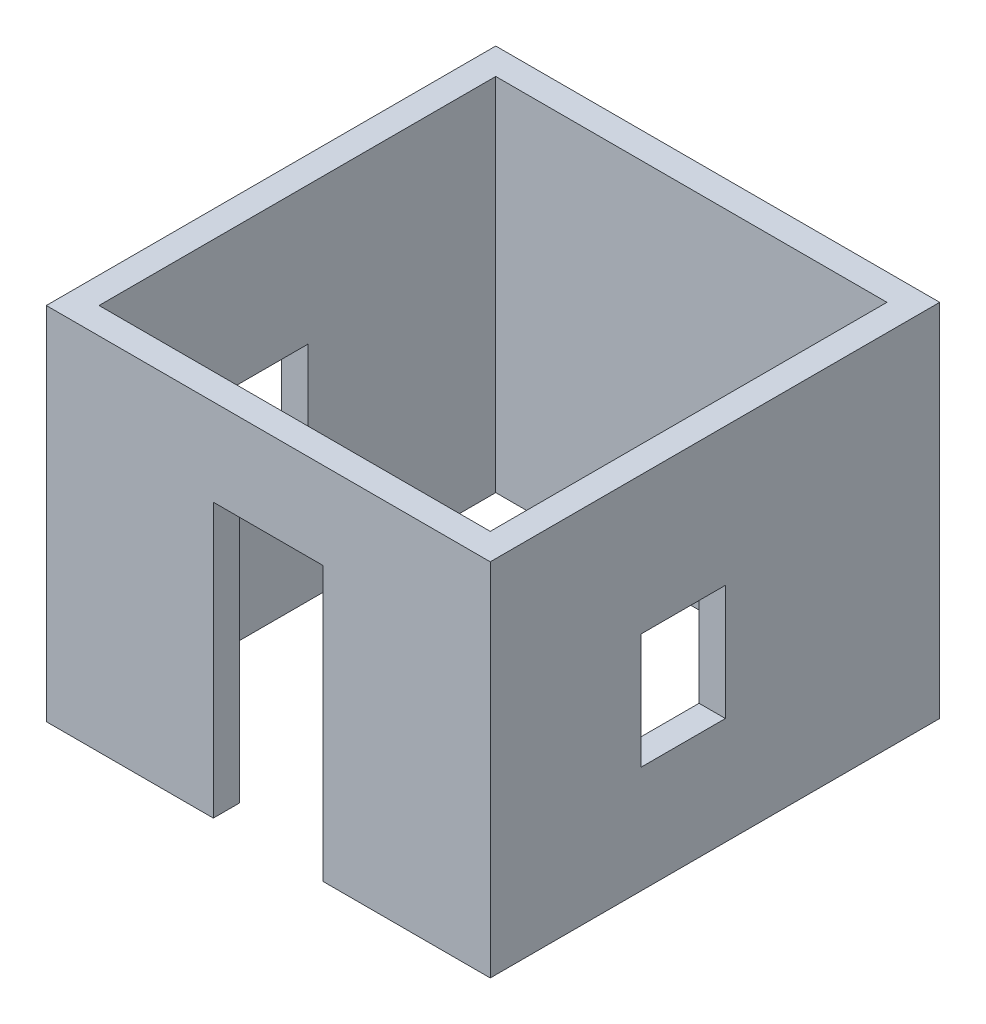
ISO-10303-21;
HEADER;
FILE_DESCRIPTION(('STEP AP214'),'2;1');
FILE_NAME('part.step','',(''),(''),'','','');
FILE_SCHEMA(('AUTOMOTIVE_DESIGN { 1 0 10303 214 1 1 1 1 }'));
ENDSEC;
DATA;
#1=APPLICATION_CONTEXT('core data for automotive mechanical design processes');
#2=APPLICATION_PROTOCOL_DEFINITION('international standard','automotive_design',2000,#1);
#3=PRODUCT_CONTEXT('',#1,'mechanical');
#4=PRODUCT('Part','Part','',(#3));
#5=PRODUCT_RELATED_PRODUCT_CATEGORY('part','',(#4));
#6=PRODUCT_DEFINITION_FORMATION('','',#4);
#7=PRODUCT_DEFINITION_CONTEXT('part definition',#1,'design');
#8=PRODUCT_DEFINITION('design','',#6,#7);
#9=PRODUCT_DEFINITION_SHAPE('','',#8);
#10=(LENGTH_UNIT() NAMED_UNIT(*) SI_UNIT(.MILLI.,.METRE.));
#11=(NAMED_UNIT(*) PLANE_ANGLE_UNIT() SI_UNIT($,.RADIAN.));
#12=(NAMED_UNIT(*) SI_UNIT($,.STERADIAN.) SOLID_ANGLE_UNIT());
#13=UNCERTAINTY_MEASURE_WITH_UNIT(LENGTH_MEASURE(1.E-05),#10,'distance_accuracy_value','');
#14=(GEOMETRIC_REPRESENTATION_CONTEXT(3) GLOBAL_UNCERTAINTY_ASSIGNED_CONTEXT((#13)) GLOBAL_UNIT_ASSIGNED_CONTEXT((#10,
#11,#12)) REPRESENTATION_CONTEXT('',''));
#15=CARTESIAN_POINT('',(0.,0.,0.));
#16=DIRECTION('',(0.,0.,1.));
#17=DIRECTION('',(1.,0.,0.));
#18=AXIS2_PLACEMENT_3D('',#15,#16,#17);
#19=CARTESIAN_POINT('',(0.,0.,0.));
#20=DIRECTION('',(0.,1.,0.));
#21=DIRECTION('',(0.,0.,1.));
#22=AXIS2_PLACEMENT_3D('',#19,#20,#21);
#23=PLANE('',#22);
#24=DIRECTION('',(1.,0.,0.));
#25=VECTOR('',#24,1.);
#26=CARTESIAN_POINT('',(0.,0.,2045.));
#27=LINE('',#26,#25);
#28=CARTESIAN_POINT('',(500.,4.44089209850063E-13,2045.));
#29=VERTEX_POINT('',#28);
#30=CARTESIAN_POINT('',(2020.,0.,2045.));
#31=VERTEX_POINT('',#30);
#32=EDGE_CURVE('E384',#29,#31,#27,.T.);
#33=ORIENTED_EDGE('',*,*,#32,.F.);
#34=DIRECTION('',(0.,0.,-1.));
#35=VECTOR('',#34,1.);
#36=CARTESIAN_POINT('',(500.,4.44089209850063E-13,2045.));
#37=LINE('',#36,#35);
#38=CARTESIAN_POINT('',(500.,4.44089209850063E-13,1805.));
#39=VERTEX_POINT('',#38);
#40=EDGE_CURVE('E289',#29,#39,#37,.T.);
#41=ORIENTED_EDGE('',*,*,#40,.T.);
#42=DIRECTION('',(1.,0.,0.));
#43=VECTOR('',#42,1.);
#44=CARTESIAN_POINT('',(-1780.,0.,1805.));
#45=LINE('',#44,#43);
#46=CARTESIAN_POINT('',(1780.,0.,1805.));
#47=VERTEX_POINT('',#46);
#48=EDGE_CURVE('E351',#39,#47,#45,.T.);
#49=ORIENTED_EDGE('',*,*,#48,.T.);
#50=DIRECTION('',(0.,0.,-1.));
#51=VECTOR('',#50,1.);
#52=CARTESIAN_POINT('',(1780.,0.,1805.));
#53=LINE('',#52,#51);
#54=CARTESIAN_POINT('',(1780.,0.,-1805.));
#55=VERTEX_POINT('',#54);
#56=EDGE_CURVE('E323',#47,#55,#53,.T.);
#57=ORIENTED_EDGE('',*,*,#56,.T.);
#58=DIRECTION('',(-1.,0.,0.));
#59=VECTOR('',#58,1.);
#60=CARTESIAN_POINT('',(-1780.,0.,-1805.));
#61=LINE('',#60,#59);
#62=CARTESIAN_POINT('',(1520.,0.,-1805.));
#63=VERTEX_POINT('',#62);
#64=EDGE_CURVE('E345',#55,#63,#61,.T.);
#65=ORIENTED_EDGE('',*,*,#64,.T.);
#66=DIRECTION('',(0.,0.,1.));
#67=VECTOR('',#66,1.);
#68=CARTESIAN_POINT('',(1520.,0.,-2045.));
#69=LINE('',#68,#67);
#70=CARTESIAN_POINT('',(1520.,0.,-2045.));
#71=VERTEX_POINT('',#70);
#72=EDGE_CURVE('E321',#71,#63,#69,.T.);
#73=ORIENTED_EDGE('',*,*,#72,.F.);
#74=DIRECTION('',(-1.,0.,0.));
#75=VECTOR('',#74,1.);
#76=CARTESIAN_POINT('',(0.,0.,-2045.));
#77=LINE('',#76,#75);
#78=CARTESIAN_POINT('',(2020.,0.,-2045.));
#79=VERTEX_POINT('',#78);
#80=EDGE_CURVE('E379',#79,#71,#77,.T.);
#81=ORIENTED_EDGE('',*,*,#80,.F.);
#82=DIRECTION('',(0.,0.,-1.));
#83=VECTOR('',#82,1.);
#84=CARTESIAN_POINT('',(2020.,0.,0.));
#85=LINE('',#84,#83);
#86=EDGE_CURVE('E364',#31,#79,#85,.T.);
#87=ORIENTED_EDGE('',*,*,#86,.F.);
#88=EDGE_LOOP('',(#33,#41,#49,#57,#65,#73,#81,#87));
#89=FACE_BOUND('',#88,.T.);
#90=ADVANCED_FACE('F62',(#89),#23,.F.);
#91=CARTESIAN_POINT('',(0.,3280.,0.));
#92=DIRECTION('',(0.,1.,0.));
#93=DIRECTION('',(0.,0.,1.));
#94=AXIS2_PLACEMENT_3D('',#91,#92,#93);
#95=PLANE('',#94);
#96=DIRECTION('',(0.,0.,-1.));
#97=VECTOR('',#96,1.);
#98=CARTESIAN_POINT('',(2020.,3280.,0.));
#99=LINE('',#98,#97);
#100=CARTESIAN_POINT('',(2020.,3280.,2045.));
#101=VERTEX_POINT('',#100);
#102=CARTESIAN_POINT('',(2020.,3280.,-2045.));
#103=VERTEX_POINT('',#102);
#104=EDGE_CURVE('E365',#101,#103,#99,.T.);
#105=ORIENTED_EDGE('',*,*,#104,.T.);
#106=DIRECTION('',(-1.,0.,0.));
#107=VECTOR('',#106,1.);
#108=CARTESIAN_POINT('',(0.,3280.,-2045.));
#109=LINE('',#108,#107);
#110=CARTESIAN_POINT('',(-2020.,3280.,-2045.));
#111=VERTEX_POINT('',#110);
#112=EDGE_CURVE('E368',#103,#111,#109,.T.);
#113=ORIENTED_EDGE('',*,*,#112,.T.);
#114=DIRECTION('',(0.,0.,1.));
#115=VECTOR('',#114,1.);
#116=CARTESIAN_POINT('',(-2020.,3280.,0.));
#117=LINE('',#116,#115);
#118=CARTESIAN_POINT('',(-2020.,3280.,2045.));
#119=VERTEX_POINT('',#118);
#120=EDGE_CURVE('E371',#111,#119,#117,.T.);
#121=ORIENTED_EDGE('',*,*,#120,.T.);
#122=DIRECTION('',(1.,0.,0.));
#123=VECTOR('',#122,1.);
#124=CARTESIAN_POINT('',(0.,3280.,2045.));
#125=LINE('',#124,#123);
#126=EDGE_CURVE('E373',#119,#101,#125,.T.);
#127=ORIENTED_EDGE('',*,*,#126,.T.);
#128=EDGE_LOOP('',(#105,#113,#121,#127));
#129=FACE_BOUND('',#128,.T.);
#130=DIRECTION('',(-1.,0.,0.));
#131=VECTOR('',#130,1.);
#132=CARTESIAN_POINT('',(-1780.,3280.,-1805.));
#133=LINE('',#132,#131);
#134=CARTESIAN_POINT('',(1780.,3280.,-1805.));
#135=VERTEX_POINT('',#134);
#136=CARTESIAN_POINT('',(-1780.,3280.,-1805.));
#137=VERTEX_POINT('',#136);
#138=EDGE_CURVE('E333',#135,#137,#133,.T.);
#139=ORIENTED_EDGE('',*,*,#138,.F.);
#140=DIRECTION('',(0.,0.,-1.));
#141=VECTOR('',#140,1.);
#142=CARTESIAN_POINT('',(1780.,3280.,1805.));
#143=LINE('',#142,#141);
#144=CARTESIAN_POINT('',(1780.,3280.,1805.));
#145=VERTEX_POINT('',#144);
#146=EDGE_CURVE('E331',#145,#135,#143,.T.);
#147=ORIENTED_EDGE('',*,*,#146,.F.);
#148=DIRECTION('',(1.,0.,0.));
#149=VECTOR('',#148,1.);
#150=CARTESIAN_POINT('',(-1780.,3280.,1805.));
#151=LINE('',#150,#149);
#152=CARTESIAN_POINT('',(-1780.,3280.,1805.));
#153=VERTEX_POINT('',#152);
#154=EDGE_CURVE('E339',#153,#145,#151,.T.);
#155=ORIENTED_EDGE('',*,*,#154,.F.);
#156=DIRECTION('',(0.,0.,1.));
#157=VECTOR('',#156,1.);
#158=CARTESIAN_POINT('',(-1780.,3280.,1805.));
#159=LINE('',#158,#157);
#160=EDGE_CURVE('E336',#137,#153,#159,.T.);
#161=ORIENTED_EDGE('',*,*,#160,.F.);
#162=EDGE_LOOP('',(#139,#147,#155,#161));
#163=FACE_BOUND('',#162,.T.);
#164=ADVANCED_FACE('F458',(#129,#163),#95,.T.);
#165=CARTESIAN_POINT('',(-1780.,0.,1805.));
#166=VERTEX_POINT('',#165);
#167=CARTESIAN_POINT('',(-500.,0.,1805.));
#168=VERTEX_POINT('',#167);
#169=EDGE_CURVE('E334',#166,#168,#45,.T.);
#170=ORIENTED_EDGE('',*,*,#169,.T.);
#171=DIRECTION('',(0.,0.,-1.));
#172=VECTOR('',#171,1.);
#173=CARTESIAN_POINT('',(-500.,5.66553889764798E-13,2045.));
#174=LINE('',#173,#172);
#175=CARTESIAN_POINT('',(-500.,5.66553889764798E-13,2045.));
#176=VERTEX_POINT('',#175);
#177=EDGE_CURVE('E301',#176,#168,#174,.T.);
#178=ORIENTED_EDGE('',*,*,#177,.F.);
#179=CARTESIAN_POINT('',(-2020.,0.,2045.));
#180=VERTEX_POINT('',#179);
#181=EDGE_CURVE('E369',#180,#176,#27,.T.);
#182=ORIENTED_EDGE('',*,*,#181,.F.);
#183=DIRECTION('',(0.,0.,1.));
#184=VECTOR('',#183,1.);
#185=CARTESIAN_POINT('',(-2020.,0.,0.));
#186=LINE('',#185,#184);
#187=CARTESIAN_POINT('',(-2020.,0.,-2045.));
#188=VERTEX_POINT('',#187);
#189=EDGE_CURVE('E382',#188,#180,#186,.T.);
#190=ORIENTED_EDGE('',*,*,#189,.F.);
#191=CARTESIAN_POINT('',(750.,0.,-2045.));
#192=VERTEX_POINT('',#191);
#193=EDGE_CURVE('E378',#192,#188,#77,.T.);
#194=ORIENTED_EDGE('',*,*,#193,.F.);
#195=DIRECTION('',(0.,0.,1.));
#196=VECTOR('',#195,1.);
#197=CARTESIAN_POINT('',(750.,0.,-2045.));
#198=LINE('',#197,#196);
#199=CARTESIAN_POINT('',(750.,0.,-1805.));
#200=VERTEX_POINT('',#199);
#201=EDGE_CURVE('E324',#192,#200,#198,.T.);
#202=ORIENTED_EDGE('',*,*,#201,.T.);
#203=CARTESIAN_POINT('',(-1780.,0.,-1805.));
#204=VERTEX_POINT('',#203);
#205=EDGE_CURVE('E344',#200,#204,#61,.T.);
#206=ORIENTED_EDGE('',*,*,#205,.T.);
#207=DIRECTION('',(0.,0.,1.));
#208=VECTOR('',#207,1.);
#209=CARTESIAN_POINT('',(-1780.,0.,1805.));
#210=LINE('',#209,#208);
#211=EDGE_CURVE('E348',#204,#166,#210,.T.);
#212=ORIENTED_EDGE('',*,*,#211,.T.);
#213=EDGE_LOOP('',(#170,#178,#182,#190,#194,#202,#206,#212));
#214=FACE_BOUND('',#213,.T.);
#215=ADVANCED_FACE('F436',(#214),#23,.F.);
#216=CARTESIAN_POINT('',(2020.,3280.,0.));
#217=DIRECTION('',(-1.,0.,0.));
#218=DIRECTION('',(0.,0.,1.));
#219=AXIS2_PLACEMENT_3D('',#216,#217,#218);
#220=PLANE('',#219);
#221=DIRECTION('',(0.,0.,1.));
#222=VECTOR('',#221,1.);
#223=CARTESIAN_POINT('',(2020.,2025.,675.));
#224=LINE('',#223,#222);
#225=CARTESIAN_POINT('',(2020.,2025.,-95.0000000000004));
#226=VERTEX_POINT('',#225);
#227=CARTESIAN_POINT('',(2020.,2025.,675.));
#228=VERTEX_POINT('',#227);
#229=EDGE_CURVE('E240',#226,#228,#224,.T.);
#230=ORIENTED_EDGE('',*,*,#229,.F.);
#231=DIRECTION('',(0.,1.,0.));
#232=VECTOR('',#231,1.);
#233=CARTESIAN_POINT('',(2020.,2025.,-95.0000000000004));
#234=LINE('',#233,#232);
#235=CARTESIAN_POINT('',(2020.,975.,-95.0000000000005));
#236=VERTEX_POINT('',#235);
#237=EDGE_CURVE('E77',#236,#226,#234,.T.);
#238=ORIENTED_EDGE('',*,*,#237,.F.);
#239=DIRECTION('',(0.,0.,-1.));
#240=VECTOR('',#239,1.);
#241=CARTESIAN_POINT('',(2020.,975.,675.));
#242=LINE('',#241,#240);
#243=CARTESIAN_POINT('',(2020.,975.,675.));
#244=VERTEX_POINT('',#243);
#245=EDGE_CURVE('E247',#244,#236,#242,.T.);
#246=ORIENTED_EDGE('',*,*,#245,.F.);
#247=DIRECTION('',(0.,-1.,0.));
#248=VECTOR('',#247,1.);
#249=CARTESIAN_POINT('',(2020.,2025.,675.));
#250=LINE('',#249,#248);
#251=EDGE_CURVE('E230',#228,#244,#250,.T.);
#252=ORIENTED_EDGE('',*,*,#251,.F.);
#253=EDGE_LOOP('',(#230,#238,#246,#252));
#254=FACE_BOUND('',#253,.T.);
#255=ORIENTED_EDGE('',*,*,#86,.T.);
#256=DIRECTION('',(0.,-1.,0.));
#257=VECTOR('',#256,1.);
#258=CARTESIAN_POINT('',(2020.,3280.,-2045.));
#259=LINE('',#258,#257);
#260=EDGE_CURVE('E395',#103,#79,#259,.T.);
#261=ORIENTED_EDGE('',*,*,#260,.F.);
#262=ORIENTED_EDGE('',*,*,#104,.F.);
#263=DIRECTION('',(0.,-1.,0.));
#264=VECTOR('',#263,1.);
#265=CARTESIAN_POINT('',(2020.,3280.,2045.));
#266=LINE('',#265,#264);
#267=EDGE_CURVE('E375',#101,#31,#266,.T.);
#268=ORIENTED_EDGE('',*,*,#267,.T.);
#269=EDGE_LOOP('',(#255,#261,#262,#268));
#270=FACE_BOUND('',#269,.T.);
#271=ADVANCED_FACE('F64',(#254,#270),#220,.F.);
#272=CARTESIAN_POINT('',(0.,3280.,-2045.));
#273=DIRECTION('',(0.,0.,1.));
#274=DIRECTION('',(1.,0.,0.));
#275=AXIS2_PLACEMENT_3D('',#272,#273,#274);
#276=PLANE('',#275);
#277=ORIENTED_EDGE('',*,*,#80,.T.);
#278=DIRECTION('',(0.,1.,0.));
#279=VECTOR('',#278,1.);
#280=CARTESIAN_POINT('',(1520.,0.,-2045.));
#281=LINE('',#280,#279);
#282=CARTESIAN_POINT('',(1520.,1960.,-2045.));
#283=VERTEX_POINT('',#282);
#284=EDGE_CURVE('E305',#71,#283,#281,.T.);
#285=ORIENTED_EDGE('',*,*,#284,.T.);
#286=DIRECTION('',(-1.,0.,0.));
#287=VECTOR('',#286,1.);
#288=CARTESIAN_POINT('',(1520.,1960.,-2045.));
#289=LINE('',#288,#287);
#290=CARTESIAN_POINT('',(750.,1960.,-2045.));
#291=VERTEX_POINT('',#290);
#292=EDGE_CURVE('E308',#283,#291,#289,.T.);
#293=ORIENTED_EDGE('',*,*,#292,.T.);
#294=DIRECTION('',(0.,-1.,0.));
#295=VECTOR('',#294,1.);
#296=CARTESIAN_POINT('',(750.,0.,-2045.));
#297=LINE('',#296,#295);
#298=EDGE_CURVE('E312',#291,#192,#297,.T.);
#299=ORIENTED_EDGE('',*,*,#298,.T.);
#300=ORIENTED_EDGE('',*,*,#193,.T.);
#301=DIRECTION('',(0.,-1.,0.));
#302=VECTOR('',#301,1.);
#303=CARTESIAN_POINT('',(-2020.,3280.,-2045.));
#304=LINE('',#303,#302);
#305=EDGE_CURVE('E392',#111,#188,#304,.T.);
#306=ORIENTED_EDGE('',*,*,#305,.F.);
#307=ORIENTED_EDGE('',*,*,#112,.F.);
#308=ORIENTED_EDGE('',*,*,#260,.T.);
#309=EDGE_LOOP('',(#277,#285,#293,#299,#300,#306,#307,#308));
#310=FACE_BOUND('',#309,.T.);
#311=ADVANCED_FACE('F423',(#310),#276,.F.);
#312=CARTESIAN_POINT('',(-2020.,3280.,0.));
#313=DIRECTION('',(1.,0.,0.));
#314=DIRECTION('',(0.,0.,-1.));
#315=AXIS2_PLACEMENT_3D('',#312,#313,#314);
#316=PLANE('',#315);
#317=DIRECTION('',(0.,0.,-1.));
#318=VECTOR('',#317,1.);
#319=CARTESIAN_POINT('',(-2020.,975.,675.));
#320=LINE('',#319,#318);
#321=CARTESIAN_POINT('',(-2020.,975.,675.));
#322=VERTEX_POINT('',#321);
#323=CARTESIAN_POINT('',(-2020.,975.,-95.0000000000005));
#324=VERTEX_POINT('',#323);
#325=EDGE_CURVE('E259',#322,#324,#320,.T.);
#326=ORIENTED_EDGE('',*,*,#325,.T.);
#327=DIRECTION('',(0.,1.,0.));
#328=VECTOR('',#327,1.);
#329=CARTESIAN_POINT('',(-2020.,2025.,-95.0000000000004));
#330=LINE('',#329,#328);
#331=CARTESIAN_POINT('',(-2020.,2025.,-95.0000000000004));
#332=VERTEX_POINT('',#331);
#333=EDGE_CURVE('E249',#324,#332,#330,.T.);
#334=ORIENTED_EDGE('',*,*,#333,.T.);
#335=DIRECTION('',(0.,0.,1.));
#336=VECTOR('',#335,1.);
#337=CARTESIAN_POINT('',(-2020.,2025.,675.));
#338=LINE('',#337,#336);
#339=CARTESIAN_POINT('',(-2020.,2025.,675.));
#340=VERTEX_POINT('',#339);
#341=EDGE_CURVE('E255',#332,#340,#338,.T.);
#342=ORIENTED_EDGE('',*,*,#341,.T.);
#343=DIRECTION('',(0.,-1.,0.));
#344=VECTOR('',#343,1.);
#345=CARTESIAN_POINT('',(-2020.,2025.,675.));
#346=LINE('',#345,#344);
#347=EDGE_CURVE('E85',#340,#322,#346,.T.);
#348=ORIENTED_EDGE('',*,*,#347,.T.);
#349=EDGE_LOOP('',(#326,#334,#342,#348));
#350=FACE_BOUND('',#349,.T.);
#351=ORIENTED_EDGE('',*,*,#189,.T.);
#352=DIRECTION('',(0.,-1.,0.));
#353=VECTOR('',#352,1.);
#354=CARTESIAN_POINT('',(-2020.,3280.,2045.));
#355=LINE('',#354,#353);
#356=EDGE_CURVE('E389',#119,#180,#355,.T.);
#357=ORIENTED_EDGE('',*,*,#356,.F.);
#358=ORIENTED_EDGE('',*,*,#120,.F.);
#359=ORIENTED_EDGE('',*,*,#305,.T.);
#360=EDGE_LOOP('',(#351,#357,#358,#359));
#361=FACE_BOUND('',#360,.T.);
#362=ADVANCED_FACE('F419',(#350,#361),#316,.F.);
#363=CARTESIAN_POINT('',(0.,3280.,2045.));
#364=DIRECTION('',(0.,0.,-1.));
#365=DIRECTION('',(-1.,0.,0.));
#366=AXIS2_PLACEMENT_3D('',#363,#364,#365);
#367=PLANE('',#366);
#368=DIRECTION('',(1.,0.,0.));
#369=VECTOR('',#368,1.);
#370=CARTESIAN_POINT('',(500.,2490.,2045.));
#371=LINE('',#370,#369);
#372=CARTESIAN_POINT('',(-500.000000000001,2490.,2045.));
#373=VERTEX_POINT('',#372);
#374=CARTESIAN_POINT('',(500.,2490.,2045.));
#375=VERTEX_POINT('',#374);
#376=EDGE_CURVE('E286',#373,#375,#371,.T.);
#377=ORIENTED_EDGE('',*,*,#376,.T.);
#378=DIRECTION('',(0.,-1.,0.));
#379=VECTOR('',#378,1.);
#380=CARTESIAN_POINT('',(500.,4.44089209850063E-13,2045.));
#381=LINE('',#380,#379);
#382=EDGE_CURVE('E279',#375,#29,#381,.T.);
#383=ORIENTED_EDGE('',*,*,#382,.T.);
#384=ORIENTED_EDGE('',*,*,#32,.T.);
#385=ORIENTED_EDGE('',*,*,#267,.F.);
#386=ORIENTED_EDGE('',*,*,#126,.F.);
#387=ORIENTED_EDGE('',*,*,#356,.T.);
#388=ORIENTED_EDGE('',*,*,#181,.T.);
#389=DIRECTION('',(0.,1.,0.));
#390=VECTOR('',#389,1.);
#391=CARTESIAN_POINT('',(-500.,5.66553889764798E-13,2045.));
#392=LINE('',#391,#390);
#393=EDGE_CURVE('E282',#176,#373,#392,.T.);
#394=ORIENTED_EDGE('',*,*,#393,.T.);
#395=EDGE_LOOP('',(#377,#383,#384,#385,#386,#387,#388,#394));
#396=FACE_BOUND('',#395,.T.);
#397=ADVANCED_FACE('F422',(#396),#367,.F.);
#398=CARTESIAN_POINT('',(1780.,3280.,1805.));
#399=DIRECTION('',(-1.,0.,0.));
#400=DIRECTION('',(0.,0.,1.));
#401=AXIS2_PLACEMENT_3D('',#398,#399,#400);
#402=PLANE('',#401);
#403=DIRECTION('',(0.,-1.,0.));
#404=VECTOR('',#403,1.);
#405=CARTESIAN_POINT('',(1780.,3280.,-95.0000000000004));
#406=LINE('',#405,#404);
#407=CARTESIAN_POINT('',(1780.,2025.,-95.0000000000004));
#408=VERTEX_POINT('',#407);
#409=CARTESIAN_POINT('',(1780.,975.,-95.0000000000005));
#410=VERTEX_POINT('',#409);
#411=EDGE_CURVE('E276',#408,#410,#406,.T.);
#412=ORIENTED_EDGE('',*,*,#411,.F.);
#413=DIRECTION('',(0.,0.,-1.));
#414=VECTOR('',#413,1.);
#415=CARTESIAN_POINT('',(1780.,2025.,1805.));
#416=LINE('',#415,#414);
#417=CARTESIAN_POINT('',(1780.,2025.,675.));
#418=VERTEX_POINT('',#417);
#419=EDGE_CURVE('E265',#418,#408,#416,.T.);
#420=ORIENTED_EDGE('',*,*,#419,.F.);
#421=DIRECTION('',(0.,1.,0.));
#422=VECTOR('',#421,1.);
#423=CARTESIAN_POINT('',(1780.,3280.,675.));
#424=LINE('',#423,#422);
#425=CARTESIAN_POINT('',(1780.,975.,675.));
#426=VERTEX_POINT('',#425);
#427=EDGE_CURVE('E233',#426,#418,#424,.T.);
#428=ORIENTED_EDGE('',*,*,#427,.F.);
#429=DIRECTION('',(0.,0.,1.));
#430=VECTOR('',#429,1.);
#431=CARTESIAN_POINT('',(1780.,975.,1805.));
#432=LINE('',#431,#430);
#433=EDGE_CURVE('E274',#410,#426,#432,.T.);
#434=ORIENTED_EDGE('',*,*,#433,.F.);
#435=EDGE_LOOP('',(#412,#420,#428,#434));
#436=FACE_BOUND('',#435,.T.);
#437=ORIENTED_EDGE('',*,*,#56,.F.);
#438=DIRECTION('',(0.,-1.,0.));
#439=VECTOR('',#438,1.);
#440=CARTESIAN_POINT('',(1780.,3280.,1805.));
#441=LINE('',#440,#439);
#442=EDGE_CURVE('E341',#145,#47,#441,.T.);
#443=ORIENTED_EDGE('',*,*,#442,.F.);
#444=ORIENTED_EDGE('',*,*,#146,.T.);
#445=DIRECTION('',(0.,-1.,0.));
#446=VECTOR('',#445,1.);
#447=CARTESIAN_POINT('',(1780.,3280.,-1805.));
#448=LINE('',#447,#446);
#449=EDGE_CURVE('E361',#135,#55,#448,.T.);
#450=ORIENTED_EDGE('',*,*,#449,.T.);
#451=EDGE_LOOP('',(#437,#443,#444,#450));
#452=FACE_BOUND('',#451,.T.);
#453=ADVANCED_FACE('F479',(#436,#452),#402,.T.);
#454=CARTESIAN_POINT('',(-1780.,3280.,-1805.));
#455=DIRECTION('',(0.,0.,1.));
#456=DIRECTION('',(1.,0.,0.));
#457=AXIS2_PLACEMENT_3D('',#454,#455,#456);
#458=PLANE('',#457);
#459=DIRECTION('',(0.,1.,0.));
#460=VECTOR('',#459,1.);
#461=CARTESIAN_POINT('',(1520.,0.,-1805.));
#462=LINE('',#461,#460);
#463=CARTESIAN_POINT('',(1520.,1960.,-1805.));
#464=VERTEX_POINT('',#463);
#465=EDGE_CURVE('E298',#63,#464,#462,.T.);
#466=ORIENTED_EDGE('',*,*,#465,.F.);
#467=ORIENTED_EDGE('',*,*,#64,.F.);
#468=ORIENTED_EDGE('',*,*,#449,.F.);
#469=ORIENTED_EDGE('',*,*,#138,.T.);
#470=DIRECTION('',(0.,-1.,0.));
#471=VECTOR('',#470,1.);
#472=CARTESIAN_POINT('',(-1780.,3280.,-1805.));
#473=LINE('',#472,#471);
#474=EDGE_CURVE('E358',#137,#204,#473,.T.);
#475=ORIENTED_EDGE('',*,*,#474,.T.);
#476=ORIENTED_EDGE('',*,*,#205,.F.);
#477=DIRECTION('',(0.,-1.,0.));
#478=VECTOR('',#477,1.);
#479=CARTESIAN_POINT('',(750.,0.,-1805.));
#480=LINE('',#479,#478);
#481=CARTESIAN_POINT('',(750.,1960.,-1805.));
#482=VERTEX_POINT('',#481);
#483=EDGE_CURVE('E309',#482,#200,#480,.T.);
#484=ORIENTED_EDGE('',*,*,#483,.F.);
#485=DIRECTION('',(-1.,0.,0.));
#486=VECTOR('',#485,1.);
#487=CARTESIAN_POINT('',(1520.,1960.,-1805.));
#488=LINE('',#487,#486);
#489=EDGE_CURVE('E317',#464,#482,#488,.T.);
#490=ORIENTED_EDGE('',*,*,#489,.F.);
#491=EDGE_LOOP('',(#466,#467,#468,#469,#475,#476,#484,#490));
#492=FACE_BOUND('',#491,.T.);
#493=ADVANCED_FACE('F467',(#492),#458,.T.);
#494=CARTESIAN_POINT('',(-1780.,3280.,1805.));
#495=DIRECTION('',(1.,0.,0.));
#496=DIRECTION('',(0.,0.,-1.));
#497=AXIS2_PLACEMENT_3D('',#494,#495,#496);
#498=PLANE('',#497);
#499=DIRECTION('',(0.,1.,0.));
#500=VECTOR('',#499,1.);
#501=CARTESIAN_POINT('',(-1780.,3280.,-95.0000000000004));
#502=LINE('',#501,#500);
#503=CARTESIAN_POINT('',(-1780.,975.,-95.0000000000005));
#504=VERTEX_POINT('',#503);
#505=CARTESIAN_POINT('',(-1780.,2025.,-95.0000000000004));
#506=VERTEX_POINT('',#505);
#507=EDGE_CURVE('E12',#504,#506,#502,.T.);
#508=ORIENTED_EDGE('',*,*,#507,.F.);
#509=DIRECTION('',(0.,0.,-1.));
#510=VECTOR('',#509,1.);
#511=CARTESIAN_POINT('',(-1780.,975.,1805.));
#512=LINE('',#511,#510);
#513=CARTESIAN_POINT('',(-1780.,975.,675.));
#514=VERTEX_POINT('',#513);
#515=EDGE_CURVE('E70',#514,#504,#512,.T.);
#516=ORIENTED_EDGE('',*,*,#515,.F.);
#517=DIRECTION('',(0.,-1.,0.));
#518=VECTOR('',#517,1.);
#519=CARTESIAN_POINT('',(-1780.,3280.,675.));
#520=LINE('',#519,#518);
#521=CARTESIAN_POINT('',(-1780.,2025.,675.));
#522=VERTEX_POINT('',#521);
#523=EDGE_CURVE('E400',#522,#514,#520,.T.);
#524=ORIENTED_EDGE('',*,*,#523,.F.);
#525=DIRECTION('',(0.,0.,1.));
#526=VECTOR('',#525,1.);
#527=CARTESIAN_POINT('',(-1780.,2025.,1805.));
#528=LINE('',#527,#526);
#529=EDGE_CURVE('E398',#506,#522,#528,.T.);
#530=ORIENTED_EDGE('',*,*,#529,.F.);
#531=EDGE_LOOP('',(#508,#516,#524,#530));
#532=FACE_BOUND('',#531,.T.);
#533=ORIENTED_EDGE('',*,*,#211,.F.);
#534=ORIENTED_EDGE('',*,*,#474,.F.);
#535=ORIENTED_EDGE('',*,*,#160,.T.);
#536=DIRECTION('',(0.,-1.,0.));
#537=VECTOR('',#536,1.);
#538=CARTESIAN_POINT('',(-1780.,3280.,1805.));
#539=LINE('',#538,#537);
#540=EDGE_CURVE('E356',#153,#166,#539,.T.);
#541=ORIENTED_EDGE('',*,*,#540,.T.);
#542=EDGE_LOOP('',(#533,#534,#535,#541));
#543=FACE_BOUND('',#542,.T.);
#544=ADVANCED_FACE('F412',(#532,#543),#498,.T.);
#545=CARTESIAN_POINT('',(-1780.,3280.,1805.));
#546=DIRECTION('',(0.,0.,-1.));
#547=DIRECTION('',(-1.,0.,0.));
#548=AXIS2_PLACEMENT_3D('',#545,#546,#547);
#549=PLANE('',#548);
#550=DIRECTION('',(0.,-1.,0.));
#551=VECTOR('',#550,1.);
#552=CARTESIAN_POINT('',(500.,4.44089209850063E-13,1805.));
#553=LINE('',#552,#551);
#554=CARTESIAN_POINT('',(500.,2490.,1805.));
#555=VERTEX_POINT('',#554);
#556=EDGE_CURVE('E278',#555,#39,#553,.T.);
#557=ORIENTED_EDGE('',*,*,#556,.F.);
#558=DIRECTION('',(1.,0.,0.));
#559=VECTOR('',#558,1.);
#560=CARTESIAN_POINT('',(500.,2490.,1805.));
#561=LINE('',#560,#559);
#562=CARTESIAN_POINT('',(-500.000000000001,2490.,1805.));
#563=VERTEX_POINT('',#562);
#564=EDGE_CURVE('E283',#563,#555,#561,.T.);
#565=ORIENTED_EDGE('',*,*,#564,.F.);
#566=DIRECTION('',(0.,1.,0.));
#567=VECTOR('',#566,1.);
#568=CARTESIAN_POINT('',(-500.,5.66553889764798E-13,1805.));
#569=LINE('',#568,#567);
#570=EDGE_CURVE('E291',#168,#563,#569,.T.);
#571=ORIENTED_EDGE('',*,*,#570,.F.);
#572=ORIENTED_EDGE('',*,*,#169,.F.);
#573=ORIENTED_EDGE('',*,*,#540,.F.);
#574=ORIENTED_EDGE('',*,*,#154,.T.);
#575=ORIENTED_EDGE('',*,*,#442,.T.);
#576=ORIENTED_EDGE('',*,*,#48,.F.);
#577=EDGE_LOOP('',(#557,#565,#571,#572,#573,#574,#575,#576));
#578=FACE_BOUND('',#577,.T.);
#579=ADVANCED_FACE('F444',(#578),#549,.T.);
#580=CARTESIAN_POINT('',(1520.,0.,-2045.));
#581=DIRECTION('',(1.,0.,0.));
#582=DIRECTION('',(0.,1.,0.));
#583=AXIS2_PLACEMENT_3D('',#580,#581,#582);
#584=PLANE('',#583);
#585=ORIENTED_EDGE('',*,*,#465,.T.);
#586=DIRECTION('',(0.,0.,1.));
#587=VECTOR('',#586,1.);
#588=CARTESIAN_POINT('',(1520.,1960.,-2045.));
#589=LINE('',#588,#587);
#590=EDGE_CURVE('E315',#283,#464,#589,.T.);
#591=ORIENTED_EDGE('',*,*,#590,.F.);
#592=ORIENTED_EDGE('',*,*,#284,.F.);
#593=ORIENTED_EDGE('',*,*,#72,.T.);
#594=EDGE_LOOP('',(#585,#591,#592,#593));
#595=FACE_BOUND('',#594,.T.);
#596=ADVANCED_FACE('F528',(#595),#584,.F.);
#597=CARTESIAN_POINT('',(750.,0.,-2045.));
#598=DIRECTION('',(-1.,0.,0.));
#599=DIRECTION('',(0.,0.,1.));
#600=AXIS2_PLACEMENT_3D('',#597,#598,#599);
#601=PLANE('',#600);
#602=ORIENTED_EDGE('',*,*,#483,.T.);
#603=ORIENTED_EDGE('',*,*,#201,.F.);
#604=ORIENTED_EDGE('',*,*,#298,.F.);
#605=DIRECTION('',(0.,0.,1.));
#606=VECTOR('',#605,1.);
#607=CARTESIAN_POINT('',(750.,1960.,-2045.));
#608=LINE('',#607,#606);
#609=EDGE_CURVE('E327',#291,#482,#608,.T.);
#610=ORIENTED_EDGE('',*,*,#609,.T.);
#611=EDGE_LOOP('',(#602,#603,#604,#610));
#612=FACE_BOUND('',#611,.T.);
#613=ADVANCED_FACE('F657',(#612),#601,.F.);
#614=CARTESIAN_POINT('',(1520.,1960.,-2045.));
#615=DIRECTION('',(0.,1.,0.));
#616=DIRECTION('',(0.,0.,1.));
#617=AXIS2_PLACEMENT_3D('',#614,#615,#616);
#618=PLANE('',#617);
#619=ORIENTED_EDGE('',*,*,#489,.T.);
#620=ORIENTED_EDGE('',*,*,#609,.F.);
#621=ORIENTED_EDGE('',*,*,#292,.F.);
#622=ORIENTED_EDGE('',*,*,#590,.T.);
#623=EDGE_LOOP('',(#619,#620,#621,#622));
#624=FACE_BOUND('',#623,.T.);
#625=ADVANCED_FACE('F543',(#624),#618,.F.);
#626=CARTESIAN_POINT('',(500.,4.44089209850063E-13,2045.));
#627=DIRECTION('',(1.,0.,0.));
#628=DIRECTION('',(0.,0.,-1.));
#629=AXIS2_PLACEMENT_3D('',#626,#627,#628);
#630=PLANE('',#629);
#631=ORIENTED_EDGE('',*,*,#556,.T.);
#632=ORIENTED_EDGE('',*,*,#40,.F.);
#633=ORIENTED_EDGE('',*,*,#382,.F.);
#634=DIRECTION('',(0.,0.,-1.));
#635=VECTOR('',#634,1.);
#636=CARTESIAN_POINT('',(500.,2490.,2045.));
#637=LINE('',#636,#635);
#638=EDGE_CURVE('E296',#375,#555,#637,.T.);
#639=ORIENTED_EDGE('',*,*,#638,.T.);
#640=EDGE_LOOP('',(#631,#632,#633,#639));
#641=FACE_BOUND('',#640,.T.);
#642=ADVANCED_FACE('F538',(#641),#630,.F.);
#643=CARTESIAN_POINT('',(500.,2490.,2045.));
#644=DIRECTION('',(0.,1.,0.));
#645=DIRECTION('',(-1.,0.,0.));
#646=AXIS2_PLACEMENT_3D('',#643,#644,#645);
#647=PLANE('',#646);
#648=ORIENTED_EDGE('',*,*,#564,.T.);
#649=ORIENTED_EDGE('',*,*,#638,.F.);
#650=ORIENTED_EDGE('',*,*,#376,.F.);
#651=DIRECTION('',(0.,0.,-1.));
#652=VECTOR('',#651,1.);
#653=CARTESIAN_POINT('',(-500.000000000001,2490.,2045.));
#654=LINE('',#653,#652);
#655=EDGE_CURVE('E299',#373,#563,#654,.T.);
#656=ORIENTED_EDGE('',*,*,#655,.T.);
#657=EDGE_LOOP('',(#648,#649,#650,#656));
#658=FACE_BOUND('',#657,.T.);
#659=ADVANCED_FACE('F447',(#658),#647,.F.);
#660=CARTESIAN_POINT('',(-500.,5.66553889764798E-13,2045.));
#661=DIRECTION('',(-1.,0.,0.));
#662=DIRECTION('',(0.,-1.,0.));
#663=AXIS2_PLACEMENT_3D('',#660,#661,#662);
#664=PLANE('',#663);
#665=ORIENTED_EDGE('',*,*,#570,.T.);
#666=ORIENTED_EDGE('',*,*,#655,.F.);
#667=ORIENTED_EDGE('',*,*,#393,.F.);
#668=ORIENTED_EDGE('',*,*,#177,.T.);
#669=EDGE_LOOP('',(#665,#666,#667,#668));
#670=FACE_BOUND('',#669,.T.);
#671=ADVANCED_FACE('F440',(#670),#664,.F.);
#672=CARTESIAN_POINT('',(-2020.,2025.,675.));
#673=DIRECTION('',(0.,1.,0.));
#674=DIRECTION('',(0.,0.,1.));
#675=AXIS2_PLACEMENT_3D('',#672,#673,#674);
#676=PLANE('',#675);
#677=ORIENTED_EDGE('',*,*,#529,.T.);
#678=DIRECTION('',(1.,0.,0.));
#679=VECTOR('',#678,1.);
#680=CARTESIAN_POINT('',(-2020.,2025.,675.));
#681=LINE('',#680,#679);
#682=EDGE_CURVE('E236',#340,#522,#681,.T.);
#683=ORIENTED_EDGE('',*,*,#682,.F.);
#684=ORIENTED_EDGE('',*,*,#341,.F.);
#685=DIRECTION('',(1.,0.,0.));
#686=VECTOR('',#685,1.);
#687=CARTESIAN_POINT('',(-2020.,2025.,-95.0000000000004));
#688=LINE('',#687,#686);
#689=EDGE_CURVE('E237',#332,#506,#688,.T.);
#690=ORIENTED_EDGE('',*,*,#689,.T.);
#691=EDGE_LOOP('',(#677,#683,#684,#690));
#692=FACE_BOUND('',#691,.T.);
#693=ADVANCED_FACE('F415',(#692),#676,.F.);
#694=CARTESIAN_POINT('',(-2020.,2025.,675.));
#695=DIRECTION('',(0.,0.,1.));
#696=DIRECTION('',(0.,-1.,0.));
#697=AXIS2_PLACEMENT_3D('',#694,#695,#696);
#698=PLANE('',#697);
#699=ORIENTED_EDGE('',*,*,#523,.T.);
#700=DIRECTION('',(1.,0.,0.));
#701=VECTOR('',#700,1.);
#702=CARTESIAN_POINT('',(-2020.,975.,675.));
#703=LINE('',#702,#701);
#704=EDGE_CURVE('E267',#322,#514,#703,.T.);
#705=ORIENTED_EDGE('',*,*,#704,.F.);
#706=ORIENTED_EDGE('',*,*,#347,.F.);
#707=ORIENTED_EDGE('',*,*,#682,.T.);
#708=EDGE_LOOP('',(#699,#705,#706,#707));
#709=FACE_BOUND('',#708,.T.);
#710=ADVANCED_FACE('F417',(#709),#698,.F.);
#711=CARTESIAN_POINT('',(-2020.,975.,675.));
#712=DIRECTION('',(0.,-1.,0.));
#713=DIRECTION('',(0.,0.,-1.));
#714=AXIS2_PLACEMENT_3D('',#711,#712,#713);
#715=PLANE('',#714);
#716=ORIENTED_EDGE('',*,*,#515,.T.);
#717=DIRECTION('',(1.,0.,0.));
#718=VECTOR('',#717,1.);
#719=CARTESIAN_POINT('',(-2020.,975.,-95.0000000000005));
#720=LINE('',#719,#718);
#721=EDGE_CURVE('E262',#324,#504,#720,.T.);
#722=ORIENTED_EDGE('',*,*,#721,.F.);
#723=ORIENTED_EDGE('',*,*,#325,.F.);
#724=ORIENTED_EDGE('',*,*,#704,.T.);
#725=EDGE_LOOP('',(#716,#722,#723,#724));
#726=FACE_BOUND('',#725,.T.);
#727=ADVANCED_FACE('F403',(#726),#715,.F.);
#728=CARTESIAN_POINT('',(-2020.,2025.,-95.0000000000004));
#729=DIRECTION('',(0.,0.,-1.));
#730=DIRECTION('',(0.,1.,0.));
#731=AXIS2_PLACEMENT_3D('',#728,#729,#730);
#732=PLANE('',#731);
#733=ORIENTED_EDGE('',*,*,#507,.T.);
#734=ORIENTED_EDGE('',*,*,#689,.F.);
#735=ORIENTED_EDGE('',*,*,#333,.F.);
#736=ORIENTED_EDGE('',*,*,#721,.T.);
#737=EDGE_LOOP('',(#733,#734,#735,#736));
#738=FACE_BOUND('',#737,.T.);
#739=ADVANCED_FACE('F410',(#738),#732,.F.);
#740=ORIENTED_EDGE('',*,*,#411,.T.);
#741=EDGE_CURVE('E266',#410,#236,#720,.T.);
#742=ORIENTED_EDGE('',*,*,#741,.T.);
#743=ORIENTED_EDGE('',*,*,#237,.T.);
#744=EDGE_CURVE('E242',#408,#226,#688,.T.);
#745=ORIENTED_EDGE('',*,*,#744,.F.);
#746=EDGE_LOOP('',(#740,#742,#743,#745));
#747=FACE_BOUND('',#746,.T.);
#748=ADVANCED_FACE('F591',(#747),#732,.F.);
#749=ORIENTED_EDGE('',*,*,#433,.T.);
#750=EDGE_CURVE('E269',#426,#244,#703,.T.);
#751=ORIENTED_EDGE('',*,*,#750,.T.);
#752=ORIENTED_EDGE('',*,*,#245,.T.);
#753=ORIENTED_EDGE('',*,*,#741,.F.);
#754=EDGE_LOOP('',(#749,#751,#752,#753));
#755=FACE_BOUND('',#754,.T.);
#756=ADVANCED_FACE('F585',(#755),#715,.F.);
#757=ORIENTED_EDGE('',*,*,#427,.T.);
#758=EDGE_CURVE('E225',#418,#228,#681,.T.);
#759=ORIENTED_EDGE('',*,*,#758,.T.);
#760=ORIENTED_EDGE('',*,*,#251,.T.);
#761=ORIENTED_EDGE('',*,*,#750,.F.);
#762=EDGE_LOOP('',(#757,#759,#760,#761));
#763=FACE_BOUND('',#762,.T.);
#764=ADVANCED_FACE('F227',(#763),#698,.F.);
#765=ORIENTED_EDGE('',*,*,#419,.T.);
#766=ORIENTED_EDGE('',*,*,#744,.T.);
#767=ORIENTED_EDGE('',*,*,#229,.T.);
#768=ORIENTED_EDGE('',*,*,#758,.F.);
#769=EDGE_LOOP('',(#765,#766,#767,#768));
#770=FACE_BOUND('',#769,.T.);
#771=ADVANCED_FACE('F241',(#770),#676,.F.);
#772=CLOSED_SHELL('',(#90,#164,#215,#271,#311,#362,#397,#453,#493,#544,#579,#596,#613,#625,#642,
#659,#671,#693,#710,#727,#739,#748,#756,#764,#771));
#773=MANIFOLD_SOLID_BREP('B2',#772);
#774=ADVANCED_BREP_SHAPE_REPRESENTATION('',(#18,#773),#14);
#775=SHAPE_DEFINITION_REPRESENTATION(#9,#774);
ENDSEC;
END-ISO-10303-21;
